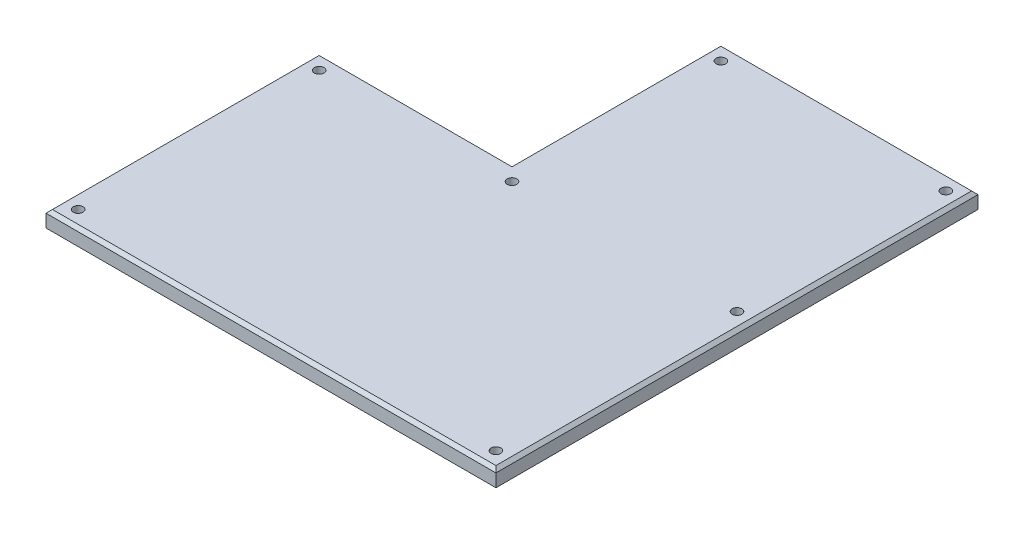
ISO-10303-21;
HEADER;
FILE_DESCRIPTION(('STEP AP214'),'2;1');
FILE_NAME('part.step','',(''),(''),'','','');
FILE_SCHEMA(('AUTOMOTIVE_DESIGN { 1 0 10303 214 1 1 1 1 }'));
ENDSEC;
DATA;
#1=APPLICATION_CONTEXT('core data for automotive mechanical design processes');
#2=APPLICATION_PROTOCOL_DEFINITION('international standard','automotive_design',2000,#1);
#3=PRODUCT_CONTEXT('',#1,'mechanical');
#4=PRODUCT('Part','Part','',(#3));
#5=PRODUCT_RELATED_PRODUCT_CATEGORY('part','',(#4));
#6=PRODUCT_DEFINITION_FORMATION('','',#4);
#7=PRODUCT_DEFINITION_CONTEXT('part definition',#1,'design');
#8=PRODUCT_DEFINITION('design','',#6,#7);
#9=PRODUCT_DEFINITION_SHAPE('','',#8);
#10=(LENGTH_UNIT() NAMED_UNIT(*) SI_UNIT(.MILLI.,.METRE.));
#11=(NAMED_UNIT(*) PLANE_ANGLE_UNIT() SI_UNIT($,.RADIAN.));
#12=(NAMED_UNIT(*) SI_UNIT($,.STERADIAN.) SOLID_ANGLE_UNIT());
#13=UNCERTAINTY_MEASURE_WITH_UNIT(LENGTH_MEASURE(1.E-05),#10,'distance_accuracy_value','');
#14=(GEOMETRIC_REPRESENTATION_CONTEXT(3) GLOBAL_UNCERTAINTY_ASSIGNED_CONTEXT((#13)) GLOBAL_UNIT_ASSIGNED_CONTEXT((#10,
#11,#12)) REPRESENTATION_CONTEXT('',''));
#15=CARTESIAN_POINT('',(0.,0.,0.));
#16=DIRECTION('',(0.,0.,1.));
#17=DIRECTION('',(1.,0.,0.));
#18=AXIS2_PLACEMENT_3D('',#15,#16,#17);
#19=CARTESIAN_POINT('',(135.,0.,-5.));
#20=DIRECTION('',(0.,1.,0.));
#21=DIRECTION('',(0.,0.,1.));
#22=AXIS2_PLACEMENT_3D('',#19,#20,#21);
#23=CYLINDRICAL_SURFACE('',#22,1.5);
#24=CARTESIAN_POINT('',(135.,0.,-5.));
#25=DIRECTION('',(0.,1.,0.));
#26=DIRECTION('',(0.,0.,1.));
#27=AXIS2_PLACEMENT_3D('',#24,#25,#26);
#28=CIRCLE('',#27,1.5);
#29=CARTESIAN_POINT('',(135.,0.,-3.5));
#30=VERTEX_POINT('',#29);
#31=EDGE_CURVE('E45',#30,#30,#28,.T.);
#32=ORIENTED_EDGE('',*,*,#31,.F.);
#33=EDGE_LOOP('',(#32));
#34=FACE_BOUND('',#33,.T.);
#35=CARTESIAN_POINT('',(135.,5.,-5.));
#36=DIRECTION('',(0.,1.,0.));
#37=DIRECTION('',(0.,0.,1.));
#38=AXIS2_PLACEMENT_3D('',#35,#36,#37);
#39=CIRCLE('',#38,1.5);
#40=CARTESIAN_POINT('',(135.,5.,-3.5));
#41=VERTEX_POINT('',#40);
#42=EDGE_CURVE('E11',#41,#41,#39,.T.);
#43=ORIENTED_EDGE('',*,*,#42,.T.);
#44=EDGE_LOOP('',(#43));
#45=FACE_BOUND('',#44,.T.);
#46=ADVANCED_FACE('F38',(#34,#45),#23,.F.);
#47=CARTESIAN_POINT('',(5.,0.,-5.));
#48=DIRECTION('',(0.,1.,0.));
#49=DIRECTION('',(0.,0.,1.));
#50=AXIS2_PLACEMENT_3D('',#47,#48,#49);
#51=CYLINDRICAL_SURFACE('',#50,1.5);
#52=CARTESIAN_POINT('',(5.,0.,-5.));
#53=DIRECTION('',(0.,1.,0.));
#54=DIRECTION('',(0.,0.,1.));
#55=AXIS2_PLACEMENT_3D('',#52,#53,#54);
#56=CIRCLE('',#55,1.5);
#57=CARTESIAN_POINT('',(5.,0.,-3.5));
#58=VERTEX_POINT('',#57);
#59=EDGE_CURVE('E178',#58,#58,#56,.T.);
#60=ORIENTED_EDGE('',*,*,#59,.F.);
#61=EDGE_LOOP('',(#60));
#62=FACE_BOUND('',#61,.T.);
#63=CARTESIAN_POINT('',(5.,5.,-5.));
#64=DIRECTION('',(0.,1.,0.));
#65=DIRECTION('',(0.,0.,1.));
#66=AXIS2_PLACEMENT_3D('',#63,#64,#65);
#67=CIRCLE('',#66,1.5);
#68=CARTESIAN_POINT('',(5.,5.,-3.5));
#69=VERTEX_POINT('',#68);
#70=EDGE_CURVE('E194',#69,#69,#67,.T.);
#71=ORIENTED_EDGE('',*,*,#70,.T.);
#72=EDGE_LOOP('',(#71));
#73=FACE_BOUND('',#72,.T.);
#74=ADVANCED_FACE('F202',(#62,#73),#51,.F.);
#75=CARTESIAN_POINT('',(0.,5.,0.));
#76=DIRECTION('',(1.,0.,0.));
#77=DIRECTION('',(0.,0.,-1.));
#78=AXIS2_PLACEMENT_3D('',#75,#76,#77);
#79=PLANE('',#78);
#80=DIRECTION('',(0.,-1.,0.));
#81=VECTOR('',#80,1.);
#82=CARTESIAN_POINT('',(0.,5.,0.));
#83=LINE('',#82,#81);
#84=CARTESIAN_POINT('',(0.,4.,0.));
#85=VERTEX_POINT('',#84);
#86=CARTESIAN_POINT('',(0.,0.,0.));
#87=VERTEX_POINT('',#86);
#88=EDGE_CURVE('E107',#85,#87,#83,.T.);
#89=ORIENTED_EDGE('',*,*,#88,.F.);
#90=DIRECTION('',(0.,0.,-1.));
#91=VECTOR('',#90,1.);
#92=CARTESIAN_POINT('',(0.,4.,0.));
#93=LINE('',#92,#91);
#94=CARTESIAN_POINT('',(0.,4.,-85.));
#95=VERTEX_POINT('',#94);
#96=EDGE_CURVE('E59',#85,#95,#93,.T.);
#97=ORIENTED_EDGE('',*,*,#96,.T.);
#98=DIRECTION('',(0.,-1.,0.));
#99=VECTOR('',#98,1.);
#100=CARTESIAN_POINT('',(0.,5.,-85.));
#101=LINE('',#100,#99);
#102=CARTESIAN_POINT('',(0.,0.,-85.));
#103=VERTEX_POINT('',#102);
#104=EDGE_CURVE('E127',#95,#103,#101,.T.);
#105=ORIENTED_EDGE('',*,*,#104,.T.);
#106=DIRECTION('',(0.,0.,1.));
#107=VECTOR('',#106,1.);
#108=CARTESIAN_POINT('',(0.,0.,0.));
#109=LINE('',#108,#107);
#110=EDGE_CURVE('E121',#103,#87,#109,.T.);
#111=ORIENTED_EDGE('',*,*,#110,.T.);
#112=EDGE_LOOP('',(#89,#97,#105,#111));
#113=FACE_BOUND('',#112,.T.);
#114=ADVANCED_FACE('F126',(#113),#79,.F.);
#115=CARTESIAN_POINT('',(0.,5.,0.));
#116=DIRECTION('',(0.,0.,-1.));
#117=DIRECTION('',(-1.,0.,0.));
#118=AXIS2_PLACEMENT_3D('',#115,#116,#117);
#119=PLANE('',#118);
#120=DIRECTION('',(0.,-1.,0.));
#121=VECTOR('',#120,1.);
#122=CARTESIAN_POINT('',(140.,5.,0.));
#123=LINE('',#122,#121);
#124=CARTESIAN_POINT('',(140.,4.,0.));
#125=VERTEX_POINT('',#124);
#126=CARTESIAN_POINT('',(140.,0.,0.));
#127=VERTEX_POINT('',#126);
#128=EDGE_CURVE('E114',#125,#127,#123,.T.);
#129=ORIENTED_EDGE('',*,*,#128,.F.);
#130=DIRECTION('',(-1.,0.,0.));
#131=VECTOR('',#130,1.);
#132=CARTESIAN_POINT('',(0.,4.,0.));
#133=LINE('',#132,#131);
#134=EDGE_CURVE('E52',#125,#85,#133,.T.);
#135=ORIENTED_EDGE('',*,*,#134,.T.);
#136=ORIENTED_EDGE('',*,*,#88,.T.);
#137=DIRECTION('',(1.,0.,0.));
#138=VECTOR('',#137,1.);
#139=CARTESIAN_POINT('',(0.,0.,0.));
#140=LINE('',#139,#138);
#141=EDGE_CURVE('E110',#87,#127,#140,.T.);
#142=ORIENTED_EDGE('',*,*,#141,.T.);
#143=EDGE_LOOP('',(#129,#135,#136,#142));
#144=FACE_BOUND('',#143,.T.);
#145=ADVANCED_FACE('F109',(#144),#119,.F.);
#146=CARTESIAN_POINT('',(140.,5.,-150.));
#147=DIRECTION('',(-1.,0.,0.));
#148=DIRECTION('',(0.,0.,1.));
#149=AXIS2_PLACEMENT_3D('',#146,#147,#148);
#150=PLANE('',#149);
#151=DIRECTION('',(0.,-1.,0.));
#152=VECTOR('',#151,1.);
#153=CARTESIAN_POINT('',(140.,5.,-150.));
#154=LINE('',#153,#152);
#155=CARTESIAN_POINT('',(140.,4.,-150.));
#156=VERTEX_POINT('',#155);
#157=CARTESIAN_POINT('',(140.,0.,-150.));
#158=VERTEX_POINT('',#157);
#159=EDGE_CURVE('E152',#156,#158,#154,.T.);
#160=ORIENTED_EDGE('',*,*,#159,.F.);
#161=DIRECTION('',(0.,0.,1.));
#162=VECTOR('',#161,1.);
#163=CARTESIAN_POINT('',(140.,4.,-150.));
#164=LINE('',#163,#162);
#165=EDGE_CURVE('E167',#156,#125,#164,.T.);
#166=ORIENTED_EDGE('',*,*,#165,.T.);
#167=ORIENTED_EDGE('',*,*,#128,.T.);
#168=DIRECTION('',(0.,0.,-1.));
#169=VECTOR('',#168,1.);
#170=CARTESIAN_POINT('',(140.,0.,-150.));
#171=LINE('',#170,#169);
#172=EDGE_CURVE('E124',#127,#158,#171,.T.);
#173=ORIENTED_EDGE('',*,*,#172,.T.);
#174=EDGE_LOOP('',(#160,#166,#167,#173));
#175=FACE_BOUND('',#174,.T.);
#176=ADVANCED_FACE('F232',(#175),#150,.F.);
#177=CARTESIAN_POINT('',(60.,5.,-150.));
#178=DIRECTION('',(0.,0.,1.));
#179=DIRECTION('',(1.,0.,0.));
#180=AXIS2_PLACEMENT_3D('',#177,#178,#179);
#181=PLANE('',#180);
#182=DIRECTION('',(0.,-1.,0.));
#183=VECTOR('',#182,1.);
#184=CARTESIAN_POINT('',(60.,5.,-150.));
#185=LINE('',#184,#183);
#186=CARTESIAN_POINT('',(60.,4.,-150.));
#187=VERTEX_POINT('',#186);
#188=CARTESIAN_POINT('',(60.,0.,-150.));
#189=VERTEX_POINT('',#188);
#190=EDGE_CURVE('E150',#187,#189,#185,.T.);
#191=ORIENTED_EDGE('',*,*,#190,.F.);
#192=DIRECTION('',(1.,0.,0.));
#193=VECTOR('',#192,1.);
#194=CARTESIAN_POINT('',(60.,4.,-150.));
#195=LINE('',#194,#193);
#196=EDGE_CURVE('E170',#187,#156,#195,.T.);
#197=ORIENTED_EDGE('',*,*,#196,.T.);
#198=ORIENTED_EDGE('',*,*,#159,.T.);
#199=DIRECTION('',(-1.,0.,0.));
#200=VECTOR('',#199,1.);
#201=CARTESIAN_POINT('',(60.,0.,-150.));
#202=LINE('',#201,#200);
#203=EDGE_CURVE('E139',#158,#189,#202,.T.);
#204=ORIENTED_EDGE('',*,*,#203,.T.);
#205=EDGE_LOOP('',(#191,#197,#198,#204));
#206=FACE_BOUND('',#205,.T.);
#207=ADVANCED_FACE('F228',(#206),#181,.F.);
#208=CARTESIAN_POINT('',(60.,5.,-85.));
#209=DIRECTION('',(1.,0.,0.));
#210=DIRECTION('',(0.,0.,-1.));
#211=AXIS2_PLACEMENT_3D('',#208,#209,#210);
#212=PLANE('',#211);
#213=DIRECTION('',(0.,-1.,0.));
#214=VECTOR('',#213,1.);
#215=CARTESIAN_POINT('',(60.,5.,-85.));
#216=LINE('',#215,#214);
#217=CARTESIAN_POINT('',(60.,4.,-85.));
#218=VERTEX_POINT('',#217);
#219=CARTESIAN_POINT('',(60.,0.,-85.));
#220=VERTEX_POINT('',#219);
#221=EDGE_CURVE('E148',#218,#220,#216,.T.);
#222=ORIENTED_EDGE('',*,*,#221,.F.);
#223=DIRECTION('',(0.,0.,-1.));
#224=VECTOR('',#223,1.);
#225=CARTESIAN_POINT('',(60.,4.,-85.));
#226=LINE('',#225,#224);
#227=EDGE_CURVE('E172',#218,#187,#226,.T.);
#228=ORIENTED_EDGE('',*,*,#227,.T.);
#229=ORIENTED_EDGE('',*,*,#190,.T.);
#230=DIRECTION('',(0.,0.,1.));
#231=VECTOR('',#230,1.);
#232=CARTESIAN_POINT('',(60.,0.,-85.));
#233=LINE('',#232,#231);
#234=EDGE_CURVE('E142',#189,#220,#233,.T.);
#235=ORIENTED_EDGE('',*,*,#234,.T.);
#236=EDGE_LOOP('',(#222,#228,#229,#235));
#237=FACE_BOUND('',#236,.T.);
#238=ADVANCED_FACE('F217',(#237),#212,.F.);
#239=CARTESIAN_POINT('',(0.,5.,-85.));
#240=DIRECTION('',(0.,0.,1.));
#241=DIRECTION('',(1.,0.,0.));
#242=AXIS2_PLACEMENT_3D('',#239,#240,#241);
#243=PLANE('',#242);
#244=ORIENTED_EDGE('',*,*,#104,.F.);
#245=DIRECTION('',(1.,0.,0.));
#246=VECTOR('',#245,1.);
#247=CARTESIAN_POINT('',(0.,4.,-85.));
#248=LINE('',#247,#246);
#249=EDGE_CURVE('E174',#95,#218,#248,.T.);
#250=ORIENTED_EDGE('',*,*,#249,.T.);
#251=ORIENTED_EDGE('',*,*,#221,.T.);
#252=DIRECTION('',(-1.,0.,0.));
#253=VECTOR('',#252,1.);
#254=CARTESIAN_POINT('',(0.,0.,-85.));
#255=LINE('',#254,#253);
#256=EDGE_CURVE('E145',#220,#103,#255,.T.);
#257=ORIENTED_EDGE('',*,*,#256,.T.);
#258=EDGE_LOOP('',(#244,#250,#251,#257));
#259=FACE_BOUND('',#258,.T.);
#260=ADVANCED_FACE('F207',(#259),#243,.F.);
#261=CARTESIAN_POINT('',(0.,5.,0.));
#262=DIRECTION('',(0.,-1.,0.));
#263=DIRECTION('',(0.,0.,-1.));
#264=AXIS2_PLACEMENT_3D('',#261,#262,#263);
#265=PLANE('',#264);
#266=CARTESIAN_POINT('',(65.,5.,-80.));
#267=DIRECTION('',(0.,1.,0.));
#268=DIRECTION('',(0.,0.,1.));
#269=AXIS2_PLACEMENT_3D('',#266,#267,#268);
#270=CIRCLE('',#269,1.5);
#271=CARTESIAN_POINT('',(65.,5.,-78.5));
#272=VERTEX_POINT('',#271);
#273=EDGE_CURVE('E423',#272,#272,#270,.T.);
#274=ORIENTED_EDGE('',*,*,#273,.F.);
#275=EDGE_LOOP('',(#274));
#276=FACE_BOUND('',#275,.T.);
#277=CARTESIAN_POINT('',(135.,5.,-145.));
#278=DIRECTION('',(0.,1.,0.));
#279=DIRECTION('',(0.,0.,1.));
#280=AXIS2_PLACEMENT_3D('',#277,#278,#279);
#281=CIRCLE('',#280,1.5);
#282=CARTESIAN_POINT('',(135.,5.,-143.5));
#283=VERTEX_POINT('',#282);
#284=EDGE_CURVE('E425',#283,#283,#281,.T.);
#285=ORIENTED_EDGE('',*,*,#284,.F.);
#286=EDGE_LOOP('',(#285));
#287=FACE_BOUND('',#286,.T.);
#288=CARTESIAN_POINT('',(65.,5.,-145.));
#289=DIRECTION('',(0.,1.,0.));
#290=DIRECTION('',(0.,0.,1.));
#291=AXIS2_PLACEMENT_3D('',#288,#289,#290);
#292=CIRCLE('',#291,1.5);
#293=CARTESIAN_POINT('',(65.,5.,-143.5));
#294=VERTEX_POINT('',#293);
#295=EDGE_CURVE('E431',#294,#294,#292,.T.);
#296=ORIENTED_EDGE('',*,*,#295,.F.);
#297=EDGE_LOOP('',(#296));
#298=FACE_BOUND('',#297,.T.);
#299=CARTESIAN_POINT('',(135.,5.,-80.));
#300=DIRECTION('',(0.,1.,0.));
#301=DIRECTION('',(0.,0.,1.));
#302=AXIS2_PLACEMENT_3D('',#299,#300,#301);
#303=CIRCLE('',#302,1.5);
#304=CARTESIAN_POINT('',(135.,5.,-78.5));
#305=VERTEX_POINT('',#304);
#306=EDGE_CURVE('E442',#305,#305,#303,.T.);
#307=ORIENTED_EDGE('',*,*,#306,.F.);
#308=EDGE_LOOP('',(#307));
#309=FACE_BOUND('',#308,.T.);
#310=CARTESIAN_POINT('',(5.,5.,-80.));
#311=DIRECTION('',(0.,1.,0.));
#312=DIRECTION('',(0.,0.,1.));
#313=AXIS2_PLACEMENT_3D('',#310,#311,#312);
#314=CIRCLE('',#313,1.5);
#315=CARTESIAN_POINT('',(5.,5.,-78.5));
#316=VERTEX_POINT('',#315);
#317=EDGE_CURVE('E135',#316,#316,#314,.T.);
#318=ORIENTED_EDGE('',*,*,#317,.F.);
#319=EDGE_LOOP('',(#318));
#320=FACE_BOUND('',#319,.T.);
#321=DIRECTION('',(1.,0.,0.));
#322=VECTOR('',#321,1.);
#323=CARTESIAN_POINT('',(0.,5.,-1.));
#324=LINE('',#323,#322);
#325=CARTESIAN_POINT('',(1.,5.,-1.));
#326=VERTEX_POINT('',#325);
#327=CARTESIAN_POINT('',(139.,5.,-1.));
#328=VERTEX_POINT('',#327);
#329=EDGE_CURVE('E113',#326,#328,#324,.T.);
#330=ORIENTED_EDGE('',*,*,#329,.T.);
#331=DIRECTION('',(0.,0.,-1.));
#332=VECTOR('',#331,1.);
#333=CARTESIAN_POINT('',(139.,5.,0.));
#334=LINE('',#333,#332);
#335=CARTESIAN_POINT('',(139.,5.,-149.));
#336=VERTEX_POINT('',#335);
#337=EDGE_CURVE('E164',#328,#336,#334,.T.);
#338=ORIENTED_EDGE('',*,*,#337,.T.);
#339=DIRECTION('',(-1.,0.,0.));
#340=VECTOR('',#339,1.);
#341=CARTESIAN_POINT('',(0.,5.,-149.));
#342=LINE('',#341,#340);
#343=CARTESIAN_POINT('',(61.,5.,-149.));
#344=VERTEX_POINT('',#343);
#345=EDGE_CURVE('E162',#336,#344,#342,.T.);
#346=ORIENTED_EDGE('',*,*,#345,.T.);
#347=DIRECTION('',(0.,0.,1.));
#348=VECTOR('',#347,1.);
#349=CARTESIAN_POINT('',(61.,5.,0.));
#350=LINE('',#349,#348);
#351=CARTESIAN_POINT('',(61.,5.,-84.));
#352=VERTEX_POINT('',#351);
#353=EDGE_CURVE('E160',#344,#352,#350,.T.);
#354=ORIENTED_EDGE('',*,*,#353,.T.);
#355=DIRECTION('',(-1.,0.,0.));
#356=VECTOR('',#355,1.);
#357=CARTESIAN_POINT('',(0.,5.,-84.));
#358=LINE('',#357,#356);
#359=CARTESIAN_POINT('',(1.,5.,-84.));
#360=VERTEX_POINT('',#359);
#361=EDGE_CURVE('E158',#352,#360,#358,.T.);
#362=ORIENTED_EDGE('',*,*,#361,.T.);
#363=DIRECTION('',(0.,0.,1.));
#364=VECTOR('',#363,1.);
#365=CARTESIAN_POINT('',(1.,5.,0.));
#366=LINE('',#365,#364);
#367=EDGE_CURVE('E156',#360,#326,#366,.T.);
#368=ORIENTED_EDGE('',*,*,#367,.T.);
#369=EDGE_LOOP('',(#330,#338,#346,#354,#362,#368));
#370=FACE_BOUND('',#369,.T.);
#371=ORIENTED_EDGE('',*,*,#70,.F.);
#372=EDGE_LOOP('',(#371));
#373=FACE_BOUND('',#372,.T.);
#374=ORIENTED_EDGE('',*,*,#42,.F.);
#375=EDGE_LOOP('',(#374));
#376=FACE_BOUND('',#375,.T.);
#377=ADVANCED_FACE('F205',(#276,#287,#298,#309,#320,#370,#373,#376),#265,.F.);
#378=CARTESIAN_POINT('',(0.,0.,0.));
#379=DIRECTION('',(0.,-1.,0.));
#380=DIRECTION('',(0.,0.,-1.));
#381=AXIS2_PLACEMENT_3D('',#378,#379,#380);
#382=PLANE('',#381);
#383=CARTESIAN_POINT('',(65.,0.,-80.));
#384=DIRECTION('',(0.,1.,0.));
#385=DIRECTION('',(0.,0.,1.));
#386=AXIS2_PLACEMENT_3D('',#383,#384,#385);
#387=CIRCLE('',#386,1.5);
#388=CARTESIAN_POINT('',(65.,0.,-78.5));
#389=VERTEX_POINT('',#388);
#390=EDGE_CURVE('E421',#389,#389,#387,.T.);
#391=ORIENTED_EDGE('',*,*,#390,.T.);
#392=EDGE_LOOP('',(#391));
#393=FACE_BOUND('',#392,.T.);
#394=CARTESIAN_POINT('',(135.,0.,-145.));
#395=DIRECTION('',(0.,1.,0.));
#396=DIRECTION('',(0.,0.,1.));
#397=AXIS2_PLACEMENT_3D('',#394,#395,#396);
#398=CIRCLE('',#397,1.5);
#399=CARTESIAN_POINT('',(135.,0.,-143.5));
#400=VERTEX_POINT('',#399);
#401=EDGE_CURVE('E428',#400,#400,#398,.T.);
#402=ORIENTED_EDGE('',*,*,#401,.T.);
#403=EDGE_LOOP('',(#402));
#404=FACE_BOUND('',#403,.T.);
#405=CARTESIAN_POINT('',(65.,0.,-145.));
#406=DIRECTION('',(0.,1.,0.));
#407=DIRECTION('',(0.,0.,1.));
#408=AXIS2_PLACEMENT_3D('',#405,#406,#407);
#409=CIRCLE('',#408,1.5);
#410=CARTESIAN_POINT('',(65.,0.,-143.5));
#411=VERTEX_POINT('',#410);
#412=EDGE_CURVE('E434',#411,#411,#409,.T.);
#413=ORIENTED_EDGE('',*,*,#412,.T.);
#414=EDGE_LOOP('',(#413));
#415=FACE_BOUND('',#414,.T.);
#416=CARTESIAN_POINT('',(135.,0.,-80.));
#417=DIRECTION('',(0.,1.,0.));
#418=DIRECTION('',(0.,0.,1.));
#419=AXIS2_PLACEMENT_3D('',#416,#417,#418);
#420=CIRCLE('',#419,1.5);
#421=CARTESIAN_POINT('',(135.,0.,-78.5));
#422=VERTEX_POINT('',#421);
#423=EDGE_CURVE('E437',#422,#422,#420,.T.);
#424=ORIENTED_EDGE('',*,*,#423,.T.);
#425=EDGE_LOOP('',(#424));
#426=FACE_BOUND('',#425,.T.);
#427=CARTESIAN_POINT('',(5.,0.,-80.));
#428=DIRECTION('',(0.,1.,0.));
#429=DIRECTION('',(0.,0.,1.));
#430=AXIS2_PLACEMENT_3D('',#427,#428,#429);
#431=CIRCLE('',#430,1.5);
#432=CARTESIAN_POINT('',(5.,0.,-78.5));
#433=VERTEX_POINT('',#432);
#434=EDGE_CURVE('E182',#433,#433,#431,.T.);
#435=ORIENTED_EDGE('',*,*,#434,.T.);
#436=EDGE_LOOP('',(#435));
#437=FACE_BOUND('',#436,.T.);
#438=ORIENTED_EDGE('',*,*,#110,.F.);
#439=ORIENTED_EDGE('',*,*,#256,.F.);
#440=ORIENTED_EDGE('',*,*,#234,.F.);
#441=ORIENTED_EDGE('',*,*,#203,.F.);
#442=ORIENTED_EDGE('',*,*,#172,.F.);
#443=ORIENTED_EDGE('',*,*,#141,.F.);
#444=EDGE_LOOP('',(#438,#439,#440,#441,#442,#443));
#445=FACE_BOUND('',#444,.T.);
#446=ORIENTED_EDGE('',*,*,#59,.T.);
#447=EDGE_LOOP('',(#446));
#448=FACE_BOUND('',#447,.T.);
#449=ORIENTED_EDGE('',*,*,#31,.T.);
#450=EDGE_LOOP('',(#449));
#451=FACE_BOUND('',#450,.T.);
#452=ADVANCED_FACE('F118',(#393,#404,#415,#426,#437,#445,#448,#451),#382,.T.);
#453=CARTESIAN_POINT('',(0.,5.,-84.));
#454=DIRECTION('',(0.,-0.707106781186547,0.707106781186547));
#455=DIRECTION('',(-1.,0.,0.));
#456=AXIS2_PLACEMENT_3D('',#453,#454,#455);
#457=PLANE('',#456);
#458=DIRECTION('',(-0.577350269189626,-0.577350269189626,-0.577350269189626));
#459=VECTOR('',#458,1.);
#460=CARTESIAN_POINT('',(89.,33.,-56.));
#461=LINE('',#460,#459);
#462=EDGE_CURVE('E132',#218,#352,#461,.F.);
#463=ORIENTED_EDGE('',*,*,#462,.F.);
#464=ORIENTED_EDGE('',*,*,#249,.F.);
#465=DIRECTION('',(-0.577350269189626,-0.577350269189626,-0.577350269189626));
#466=VECTOR('',#465,1.);
#467=CARTESIAN_POINT('',(29.,33.,-56.));
#468=LINE('',#467,#466);
#469=EDGE_CURVE('E129',#360,#95,#468,.T.);
#470=ORIENTED_EDGE('',*,*,#469,.F.);
#471=ORIENTED_EDGE('',*,*,#361,.F.);
#472=EDGE_LOOP('',(#463,#464,#470,#471));
#473=FACE_BOUND('',#472,.T.);
#474=ADVANCED_FACE('F214',(#473),#457,.F.);
#475=CARTESIAN_POINT('',(1.,5.,0.));
#476=DIRECTION('',(0.707106781186547,-0.707106781186547,0.));
#477=DIRECTION('',(0.,0.,1.));
#478=AXIS2_PLACEMENT_3D('',#475,#476,#477);
#479=PLANE('',#478);
#480=ORIENTED_EDGE('',*,*,#469,.T.);
#481=ORIENTED_EDGE('',*,*,#96,.F.);
#482=DIRECTION('',(-0.577350269189626,-0.577350269189626,0.577350269189626));
#483=VECTOR('',#482,1.);
#484=CARTESIAN_POINT('',(0.666666666666667,4.66666666666667,-0.666666666666667));
#485=LINE('',#484,#483);
#486=EDGE_CURVE('E187',#326,#85,#485,.T.);
#487=ORIENTED_EDGE('',*,*,#486,.F.);
#488=ORIENTED_EDGE('',*,*,#367,.F.);
#489=EDGE_LOOP('',(#480,#481,#487,#488));
#490=FACE_BOUND('',#489,.T.);
#491=ADVANCED_FACE('F269',(#490),#479,.F.);
#492=CARTESIAN_POINT('',(61.,5.,0.));
#493=DIRECTION('',(0.707106781186547,-0.707106781186547,0.));
#494=DIRECTION('',(0.,0.,1.));
#495=AXIS2_PLACEMENT_3D('',#492,#493,#494);
#496=PLANE('',#495);
#497=ORIENTED_EDGE('',*,*,#462,.T.);
#498=ORIENTED_EDGE('',*,*,#353,.F.);
#499=DIRECTION('',(-0.577350269189626,-0.577350269189626,-0.577350269189626));
#500=VECTOR('',#499,1.);
#501=CARTESIAN_POINT('',(110.666666666667,54.6666666666667,-99.3333333333333));
#502=LINE('',#501,#500);
#503=EDGE_CURVE('E184',#187,#344,#502,.F.);
#504=ORIENTED_EDGE('',*,*,#503,.F.);
#505=ORIENTED_EDGE('',*,*,#227,.F.);
#506=EDGE_LOOP('',(#497,#498,#504,#505));
#507=FACE_BOUND('',#506,.T.);
#508=ADVANCED_FACE('F262',(#507),#496,.F.);
#509=CARTESIAN_POINT('',(0.,5.,-1.));
#510=DIRECTION('',(0.,-0.707106781186547,-0.707106781186547));
#511=DIRECTION('',(1.,0.,0.));
#512=AXIS2_PLACEMENT_3D('',#509,#510,#511);
#513=PLANE('',#512);
#514=ORIENTED_EDGE('',*,*,#486,.T.);
#515=ORIENTED_EDGE('',*,*,#134,.F.);
#516=DIRECTION('',(-0.577350269189626,0.577350269189626,-0.577350269189626));
#517=VECTOR('',#516,1.);
#518=CARTESIAN_POINT('',(92.6666666666667,51.3333333333333,-47.3333333333333));
#519=LINE('',#518,#517);
#520=EDGE_CURVE('E181',#328,#125,#519,.F.);
#521=ORIENTED_EDGE('',*,*,#520,.F.);
#522=ORIENTED_EDGE('',*,*,#329,.F.);
#523=EDGE_LOOP('',(#514,#515,#521,#522));
#524=FACE_BOUND('',#523,.T.);
#525=ADVANCED_FACE('F255',(#524),#513,.F.);
#526=CARTESIAN_POINT('',(0.,5.,-149.));
#527=DIRECTION('',(0.,-0.707106781186547,0.707106781186547));
#528=DIRECTION('',(-1.,0.,0.));
#529=AXIS2_PLACEMENT_3D('',#526,#527,#528);
#530=PLANE('',#529);
#531=ORIENTED_EDGE('',*,*,#503,.T.);
#532=ORIENTED_EDGE('',*,*,#345,.F.);
#533=DIRECTION('',(0.577350269189626,-0.577350269189626,-0.577350269189626));
#534=VECTOR('',#533,1.);
#535=CARTESIAN_POINT('',(92.6666666666667,51.3333333333333,-102.666666666667));
#536=LINE('',#535,#534);
#537=EDGE_CURVE('E179',#156,#336,#536,.F.);
#538=ORIENTED_EDGE('',*,*,#537,.F.);
#539=ORIENTED_EDGE('',*,*,#196,.F.);
#540=EDGE_LOOP('',(#531,#532,#538,#539));
#541=FACE_BOUND('',#540,.T.);
#542=ADVANCED_FACE('F248',(#541),#530,.F.);
#543=CARTESIAN_POINT('',(139.,5.,0.));
#544=DIRECTION('',(-0.707106781186547,-0.707106781186547,0.));
#545=DIRECTION('',(0.,0.,-1.));
#546=AXIS2_PLACEMENT_3D('',#543,#544,#545);
#547=PLANE('',#546);
#548=ORIENTED_EDGE('',*,*,#520,.T.);
#549=ORIENTED_EDGE('',*,*,#165,.F.);
#550=ORIENTED_EDGE('',*,*,#537,.T.);
#551=ORIENTED_EDGE('',*,*,#337,.F.);
#552=EDGE_LOOP('',(#548,#549,#550,#551));
#553=FACE_BOUND('',#552,.T.);
#554=ADVANCED_FACE('F242',(#553),#547,.F.);
#555=CARTESIAN_POINT('',(5.,0.,-80.));
#556=DIRECTION('',(0.,1.,0.));
#557=DIRECTION('',(0.,0.,1.));
#558=AXIS2_PLACEMENT_3D('',#555,#556,#557);
#559=CYLINDRICAL_SURFACE('',#558,1.5);
#560=ORIENTED_EDGE('',*,*,#434,.F.);
#561=EDGE_LOOP('',(#560));
#562=FACE_BOUND('',#561,.T.);
#563=ORIENTED_EDGE('',*,*,#317,.T.);
#564=EDGE_LOOP('',(#563));
#565=FACE_BOUND('',#564,.T.);
#566=ADVANCED_FACE('F223',(#562,#565),#559,.F.);
#567=CARTESIAN_POINT('',(135.,0.,-80.));
#568=DIRECTION('',(0.,1.,0.));
#569=DIRECTION('',(0.,0.,1.));
#570=AXIS2_PLACEMENT_3D('',#567,#568,#569);
#571=CYLINDRICAL_SURFACE('',#570,1.5);
#572=ORIENTED_EDGE('',*,*,#423,.F.);
#573=EDGE_LOOP('',(#572));
#574=FACE_BOUND('',#573,.T.);
#575=ORIENTED_EDGE('',*,*,#306,.T.);
#576=EDGE_LOOP('',(#575));
#577=FACE_BOUND('',#576,.T.);
#578=ADVANCED_FACE('F362',(#574,#577),#571,.F.);
#579=CARTESIAN_POINT('',(65.,0.,-145.));
#580=DIRECTION('',(0.,1.,0.));
#581=DIRECTION('',(0.,0.,1.));
#582=AXIS2_PLACEMENT_3D('',#579,#580,#581);
#583=CYLINDRICAL_SURFACE('',#582,1.5);
#584=ORIENTED_EDGE('',*,*,#412,.F.);
#585=EDGE_LOOP('',(#584));
#586=FACE_BOUND('',#585,.T.);
#587=ORIENTED_EDGE('',*,*,#295,.T.);
#588=EDGE_LOOP('',(#587));
#589=FACE_BOUND('',#588,.T.);
#590=ADVANCED_FACE('F378',(#586,#589),#583,.F.);
#591=CARTESIAN_POINT('',(135.,0.,-145.));
#592=DIRECTION('',(0.,1.,0.));
#593=DIRECTION('',(0.,0.,1.));
#594=AXIS2_PLACEMENT_3D('',#591,#592,#593);
#595=CYLINDRICAL_SURFACE('',#594,1.5);
#596=ORIENTED_EDGE('',*,*,#401,.F.);
#597=EDGE_LOOP('',(#596));
#598=FACE_BOUND('',#597,.T.);
#599=ORIENTED_EDGE('',*,*,#284,.T.);
#600=EDGE_LOOP('',(#599));
#601=FACE_BOUND('',#600,.T.);
#602=ADVANCED_FACE('F386',(#598,#601),#595,.F.);
#603=CARTESIAN_POINT('',(65.,0.,-80.));
#604=DIRECTION('',(0.,1.,0.));
#605=DIRECTION('',(0.,0.,1.));
#606=AXIS2_PLACEMENT_3D('',#603,#604,#605);
#607=CYLINDRICAL_SURFACE('',#606,1.5);
#608=ORIENTED_EDGE('',*,*,#390,.F.);
#609=EDGE_LOOP('',(#608));
#610=FACE_BOUND('',#609,.T.);
#611=ORIENTED_EDGE('',*,*,#273,.T.);
#612=EDGE_LOOP('',(#611));
#613=FACE_BOUND('',#612,.T.);
#614=ADVANCED_FACE('F395',(#610,#613),#607,.F.);
#615=CLOSED_SHELL('',(#46,#74,#114,#145,#176,#207,#238,#260,#377,#452,#474,#491,#508,#525,#542,
#554,#566,#578,#590,#602,#614));
#616=MANIFOLD_SOLID_BREP('B2',#615);
#617=ADVANCED_BREP_SHAPE_REPRESENTATION('',(#18,#616),#14);
#618=SHAPE_DEFINITION_REPRESENTATION(#9,#617);
ENDSEC;
END-ISO-10303-21;
